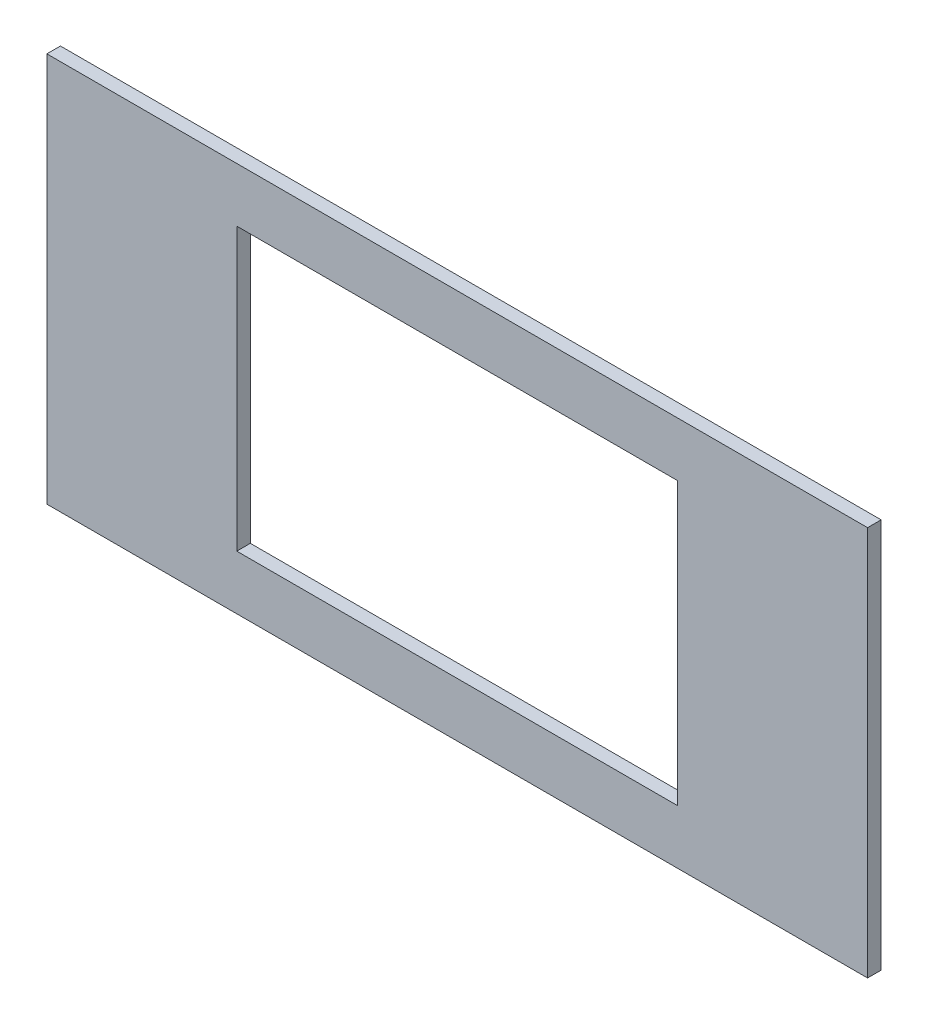
ISO-10303-21;
HEADER;
FILE_DESCRIPTION(('STEP AP214'),'2;1');
FILE_NAME('part.step','',(''),(''),'','','');
FILE_SCHEMA(('AUTOMOTIVE_DESIGN { 1 0 10303 214 1 1 1 1 }'));
ENDSEC;
DATA;
#1=APPLICATION_CONTEXT('core data for automotive mechanical design processes');
#2=APPLICATION_PROTOCOL_DEFINITION('international standard','automotive_design',2000,#1);
#3=PRODUCT_CONTEXT('',#1,'mechanical');
#4=PRODUCT('Part','Part','',(#3));
#5=PRODUCT_RELATED_PRODUCT_CATEGORY('part','',(#4));
#6=PRODUCT_DEFINITION_FORMATION('','',#4);
#7=PRODUCT_DEFINITION_CONTEXT('part definition',#1,'design');
#8=PRODUCT_DEFINITION('design','',#6,#7);
#9=PRODUCT_DEFINITION_SHAPE('','',#8);
#10=(LENGTH_UNIT() NAMED_UNIT(*) SI_UNIT(.MILLI.,.METRE.));
#11=(NAMED_UNIT(*) PLANE_ANGLE_UNIT() SI_UNIT($,.RADIAN.));
#12=(NAMED_UNIT(*) SI_UNIT($,.STERADIAN.) SOLID_ANGLE_UNIT());
#13=UNCERTAINTY_MEASURE_WITH_UNIT(LENGTH_MEASURE(1.E-05),#10,'distance_accuracy_value','');
#14=(GEOMETRIC_REPRESENTATION_CONTEXT(3) GLOBAL_UNCERTAINTY_ASSIGNED_CONTEXT((#13)) GLOBAL_UNIT_ASSIGNED_CONTEXT((#10,
#11,#12)) REPRESENTATION_CONTEXT('',''));
#15=CARTESIAN_POINT('',(0.,0.,0.));
#16=DIRECTION('',(0.,0.,1.));
#17=DIRECTION('',(1.,0.,0.));
#18=AXIS2_PLACEMENT_3D('',#15,#16,#17);
#19=CARTESIAN_POINT('',(0.,0.,4.));
#20=DIRECTION('',(0.,0.,1.));
#21=DIRECTION('',(1.,0.,0.));
#22=AXIS2_PLACEMENT_3D('',#19,#20,#21);
#23=PLANE('',#22);
#24=DIRECTION('',(0.,-1.,0.));
#25=VECTOR('',#24,1.);
#26=CARTESIAN_POINT('',(-99.0399274047187,66.2096188747731,4.));
#27=LINE('',#26,#25);
#28=CARTESIAN_POINT('',(-99.0399274047187,66.2096188747731,4.));
#29=VERTEX_POINT('',#28);
#30=CARTESIAN_POINT('',(-99.0399274047187,-48.7903811252269,4.));
#31=VERTEX_POINT('',#30);
#32=EDGE_CURVE('E157',#29,#31,#27,.T.);
#33=ORIENTED_EDGE('',*,*,#32,.T.);
#34=DIRECTION('',(1.,0.,0.));
#35=VECTOR('',#34,1.);
#36=CARTESIAN_POINT('',(-99.0399274047187,-48.7903811252269,4.));
#37=LINE('',#36,#35);
#38=CARTESIAN_POINT('',(142.960072595281,-48.7903811252269,4.));
#39=VERTEX_POINT('',#38);
#40=EDGE_CURVE('E161',#31,#39,#37,.T.);
#41=ORIENTED_EDGE('',*,*,#40,.T.);
#42=DIRECTION('',(0.,1.,0.));
#43=VECTOR('',#42,1.);
#44=CARTESIAN_POINT('',(142.960072595281,66.2096188747731,4.));
#45=LINE('',#44,#43);
#46=CARTESIAN_POINT('',(142.960072595281,66.2096188747731,4.));
#47=VERTEX_POINT('',#46);
#48=EDGE_CURVE('E165',#39,#47,#45,.T.);
#49=ORIENTED_EDGE('',*,*,#48,.T.);
#50=DIRECTION('',(-1.,0.,0.));
#51=VECTOR('',#50,1.);
#52=CARTESIAN_POINT('',(-99.0399274047187,66.2096188747731,4.));
#53=LINE('',#52,#51);
#54=EDGE_CURVE('E168',#47,#29,#53,.T.);
#55=ORIENTED_EDGE('',*,*,#54,.T.);
#56=EDGE_LOOP('',(#33,#41,#49,#55));
#57=FACE_BOUND('',#56,.T.);
#58=DIRECTION('',(1.,0.,0.));
#59=VECTOR('',#58,1.);
#60=CARTESIAN_POINT('',(-43.0399274047187,-32.7903811252269,4.));
#61=LINE('',#60,#59);
#62=CARTESIAN_POINT('',(-43.0399274047187,-32.7903811252269,4.));
#63=VERTEX_POINT('',#62);
#64=CARTESIAN_POINT('',(86.9600725952813,-32.7903811252269,4.));
#65=VERTEX_POINT('',#64);
#66=EDGE_CURVE('E118',#63,#65,#61,.T.);
#67=ORIENTED_EDGE('',*,*,#66,.F.);
#68=DIRECTION('',(0.,-1.,0.));
#69=VECTOR('',#68,1.);
#70=CARTESIAN_POINT('',(-43.0399274047187,50.2096188747731,4.));
#71=LINE('',#70,#69);
#72=CARTESIAN_POINT('',(-43.0399274047187,50.2096188747731,4.));
#73=VERTEX_POINT('',#72);
#74=EDGE_CURVE('E109',#73,#63,#71,.T.);
#75=ORIENTED_EDGE('',*,*,#74,.F.);
#76=DIRECTION('',(-1.,0.,0.));
#77=VECTOR('',#76,1.);
#78=CARTESIAN_POINT('',(-43.0399274047187,50.2096188747731,4.));
#79=LINE('',#78,#77);
#80=CARTESIAN_POINT('',(86.9600725952813,50.2096188747731,4.));
#81=VERTEX_POINT('',#80);
#82=EDGE_CURVE('E135',#81,#73,#79,.T.);
#83=ORIENTED_EDGE('',*,*,#82,.F.);
#84=DIRECTION('',(0.,1.,0.));
#85=VECTOR('',#84,1.);
#86=CARTESIAN_POINT('',(86.9600725952813,50.2096188747731,4.));
#87=LINE('',#86,#85);
#88=EDGE_CURVE('E131',#65,#81,#87,.T.);
#89=ORIENTED_EDGE('',*,*,#88,.F.);
#90=EDGE_LOOP('',(#67,#75,#83,#89));
#91=FACE_BOUND('',#90,.T.);
#92=ADVANCED_FACE('F43',(#57,#91),#23,.T.);
#93=CARTESIAN_POINT('',(0.,0.,0.));
#94=DIRECTION('',(0.,0.,1.));
#95=DIRECTION('',(1.,0.,0.));
#96=AXIS2_PLACEMENT_3D('',#93,#94,#95);
#97=PLANE('',#96);
#98=DIRECTION('',(0.,-1.,0.));
#99=VECTOR('',#98,1.);
#100=CARTESIAN_POINT('',(-99.0399274047187,66.2096188747731,0.));
#101=LINE('',#100,#99);
#102=CARTESIAN_POINT('',(-99.0399274047187,66.2096188747731,0.));
#103=VERTEX_POINT('',#102);
#104=CARTESIAN_POINT('',(-99.0399274047187,-48.7903811252269,0.));
#105=VERTEX_POINT('',#104);
#106=EDGE_CURVE('E127',#103,#105,#101,.T.);
#107=ORIENTED_EDGE('',*,*,#106,.F.);
#108=DIRECTION('',(-1.,0.,0.));
#109=VECTOR('',#108,1.);
#110=CARTESIAN_POINT('',(-99.0399274047187,66.2096188747731,0.));
#111=LINE('',#110,#109);
#112=CARTESIAN_POINT('',(142.960072595281,66.2096188747731,0.));
#113=VERTEX_POINT('',#112);
#114=EDGE_CURVE('E162',#113,#103,#111,.T.);
#115=ORIENTED_EDGE('',*,*,#114,.F.);
#116=DIRECTION('',(0.,1.,0.));
#117=VECTOR('',#116,1.);
#118=CARTESIAN_POINT('',(142.960072595281,66.2096188747731,0.));
#119=LINE('',#118,#117);
#120=CARTESIAN_POINT('',(142.960072595281,-48.7903811252269,0.));
#121=VERTEX_POINT('',#120);
#122=EDGE_CURVE('E178',#121,#113,#119,.T.);
#123=ORIENTED_EDGE('',*,*,#122,.F.);
#124=DIRECTION('',(1.,0.,0.));
#125=VECTOR('',#124,1.);
#126=CARTESIAN_POINT('',(-99.0399274047187,-48.7903811252269,0.));
#127=LINE('',#126,#125);
#128=EDGE_CURVE('E175',#105,#121,#127,.T.);
#129=ORIENTED_EDGE('',*,*,#128,.F.);
#130=EDGE_LOOP('',(#107,#115,#123,#129));
#131=FACE_BOUND('',#130,.T.);
#132=DIRECTION('',(0.,-1.,0.));
#133=VECTOR('',#132,1.);
#134=CARTESIAN_POINT('',(-43.0399274047187,50.2096188747731,0.));
#135=LINE('',#134,#133);
#136=CARTESIAN_POINT('',(-43.0399274047187,50.2096188747731,0.));
#137=VERTEX_POINT('',#136);
#138=CARTESIAN_POINT('',(-43.0399274047187,-32.7903811252269,0.));
#139=VERTEX_POINT('',#138);
#140=EDGE_CURVE('E67',#137,#139,#135,.T.);
#141=ORIENTED_EDGE('',*,*,#140,.T.);
#142=DIRECTION('',(1.,0.,0.));
#143=VECTOR('',#142,1.);
#144=CARTESIAN_POINT('',(-43.0399274047187,-32.7903811252269,0.));
#145=LINE('',#144,#143);
#146=CARTESIAN_POINT('',(86.9600725952813,-32.7903811252269,0.));
#147=VERTEX_POINT('',#146);
#148=EDGE_CURVE('E125',#139,#147,#145,.T.);
#149=ORIENTED_EDGE('',*,*,#148,.T.);
#150=DIRECTION('',(0.,1.,0.));
#151=VECTOR('',#150,1.);
#152=CARTESIAN_POINT('',(86.9600725952813,50.2096188747731,0.));
#153=LINE('',#152,#151);
#154=CARTESIAN_POINT('',(86.9600725952813,50.2096188747731,0.));
#155=VERTEX_POINT('',#154);
#156=EDGE_CURVE('E144',#147,#155,#153,.T.);
#157=ORIENTED_EDGE('',*,*,#156,.T.);
#158=DIRECTION('',(-1.,0.,0.));
#159=VECTOR('',#158,1.);
#160=CARTESIAN_POINT('',(-43.0399274047187,50.2096188747731,0.));
#161=LINE('',#160,#159);
#162=EDGE_CURVE('E119',#155,#137,#161,.T.);
#163=ORIENTED_EDGE('',*,*,#162,.T.);
#164=EDGE_LOOP('',(#141,#149,#157,#163));
#165=FACE_BOUND('',#164,.T.);
#166=ADVANCED_FACE('F201',(#131,#165),#97,.F.);
#167=CARTESIAN_POINT('',(-99.0399274047187,66.2096188747731,4.));
#168=DIRECTION('',(1.,0.,0.));
#169=DIRECTION('',(0.,1.,0.));
#170=AXIS2_PLACEMENT_3D('',#167,#168,#169);
#171=PLANE('',#170);
#172=ORIENTED_EDGE('',*,*,#106,.T.);
#173=DIRECTION('',(0.,0.,-1.));
#174=VECTOR('',#173,1.);
#175=CARTESIAN_POINT('',(-99.0399274047187,-48.7903811252269,4.));
#176=LINE('',#175,#174);
#177=EDGE_CURVE('E11',#31,#105,#176,.T.);
#178=ORIENTED_EDGE('',*,*,#177,.F.);
#179=ORIENTED_EDGE('',*,*,#32,.F.);
#180=DIRECTION('',(0.,0.,-1.));
#181=VECTOR('',#180,1.);
#182=CARTESIAN_POINT('',(-99.0399274047187,66.2096188747731,4.));
#183=LINE('',#182,#181);
#184=EDGE_CURVE('E171',#29,#103,#183,.T.);
#185=ORIENTED_EDGE('',*,*,#184,.T.);
#186=EDGE_LOOP('',(#172,#178,#179,#185));
#187=FACE_BOUND('',#186,.T.);
#188=ADVANCED_FACE('F45',(#187),#171,.F.);
#189=CARTESIAN_POINT('',(-99.0399274047187,-48.7903811252269,4.));
#190=DIRECTION('',(0.,1.,0.));
#191=DIRECTION('',(0.,0.,1.));
#192=AXIS2_PLACEMENT_3D('',#189,#190,#191);
#193=PLANE('',#192);
#194=ORIENTED_EDGE('',*,*,#128,.T.);
#195=DIRECTION('',(0.,0.,-1.));
#196=VECTOR('',#195,1.);
#197=CARTESIAN_POINT('',(142.960072595281,-48.7903811252269,4.));
#198=LINE('',#197,#196);
#199=EDGE_CURVE('E52',#39,#121,#198,.T.);
#200=ORIENTED_EDGE('',*,*,#199,.F.);
#201=ORIENTED_EDGE('',*,*,#40,.F.);
#202=ORIENTED_EDGE('',*,*,#177,.T.);
#203=EDGE_LOOP('',(#194,#200,#201,#202));
#204=FACE_BOUND('',#203,.T.);
#205=ADVANCED_FACE('F211',(#204),#193,.F.);
#206=CARTESIAN_POINT('',(142.960072595281,66.2096188747731,4.));
#207=DIRECTION('',(-1.,0.,0.));
#208=DIRECTION('',(0.,-1.,0.));
#209=AXIS2_PLACEMENT_3D('',#206,#207,#208);
#210=PLANE('',#209);
#211=ORIENTED_EDGE('',*,*,#122,.T.);
#212=DIRECTION('',(0.,0.,-1.));
#213=VECTOR('',#212,1.);
#214=CARTESIAN_POINT('',(142.960072595281,66.2096188747731,4.));
#215=LINE('',#214,#213);
#216=EDGE_CURVE('E186',#47,#113,#215,.T.);
#217=ORIENTED_EDGE('',*,*,#216,.F.);
#218=ORIENTED_EDGE('',*,*,#48,.F.);
#219=ORIENTED_EDGE('',*,*,#199,.T.);
#220=EDGE_LOOP('',(#211,#217,#218,#219));
#221=FACE_BOUND('',#220,.T.);
#222=ADVANCED_FACE('F195',(#221),#210,.F.);
#223=CARTESIAN_POINT('',(-99.0399274047187,66.2096188747731,4.));
#224=DIRECTION('',(0.,-1.,0.));
#225=DIRECTION('',(0.,0.,-1.));
#226=AXIS2_PLACEMENT_3D('',#223,#224,#225);
#227=PLANE('',#226);
#228=ORIENTED_EDGE('',*,*,#114,.T.);
#229=ORIENTED_EDGE('',*,*,#184,.F.);
#230=ORIENTED_EDGE('',*,*,#54,.F.);
#231=ORIENTED_EDGE('',*,*,#216,.T.);
#232=EDGE_LOOP('',(#228,#229,#230,#231));
#233=FACE_BOUND('',#232,.T.);
#234=ADVANCED_FACE('F205',(#233),#227,.F.);
#235=CARTESIAN_POINT('',(-43.0399274047187,50.2096188747731,4.));
#236=DIRECTION('',(1.,0.,0.));
#237=DIRECTION('',(0.,1.,0.));
#238=AXIS2_PLACEMENT_3D('',#235,#236,#237);
#239=PLANE('',#238);
#240=ORIENTED_EDGE('',*,*,#140,.F.);
#241=DIRECTION('',(0.,0.,-1.));
#242=VECTOR('',#241,1.);
#243=CARTESIAN_POINT('',(-43.0399274047187,50.2096188747731,4.));
#244=LINE('',#243,#242);
#245=EDGE_CURVE('E113',#73,#137,#244,.T.);
#246=ORIENTED_EDGE('',*,*,#245,.F.);
#247=ORIENTED_EDGE('',*,*,#74,.T.);
#248=DIRECTION('',(0.,0.,-1.));
#249=VECTOR('',#248,1.);
#250=CARTESIAN_POINT('',(-43.0399274047187,-32.7903811252269,4.));
#251=LINE('',#250,#249);
#252=EDGE_CURVE('E112',#63,#139,#251,.T.);
#253=ORIENTED_EDGE('',*,*,#252,.T.);
#254=EDGE_LOOP('',(#240,#246,#247,#253));
#255=FACE_BOUND('',#254,.T.);
#256=ADVANCED_FACE('F111',(#255),#239,.T.);
#257=CARTESIAN_POINT('',(-43.0399274047187,-32.7903811252269,4.));
#258=DIRECTION('',(0.,1.,0.));
#259=DIRECTION('',(0.,0.,1.));
#260=AXIS2_PLACEMENT_3D('',#257,#258,#259);
#261=PLANE('',#260);
#262=ORIENTED_EDGE('',*,*,#148,.F.);
#263=ORIENTED_EDGE('',*,*,#252,.F.);
#264=ORIENTED_EDGE('',*,*,#66,.T.);
#265=DIRECTION('',(0.,0.,-1.));
#266=VECTOR('',#265,1.);
#267=CARTESIAN_POINT('',(86.9600725952813,-32.7903811252269,4.));
#268=LINE('',#267,#266);
#269=EDGE_CURVE('E128',#65,#147,#268,.T.);
#270=ORIENTED_EDGE('',*,*,#269,.T.);
#271=EDGE_LOOP('',(#262,#263,#264,#270));
#272=FACE_BOUND('',#271,.T.);
#273=ADVANCED_FACE('F122',(#272),#261,.T.);
#274=CARTESIAN_POINT('',(86.9600725952813,50.2096188747731,4.));
#275=DIRECTION('',(-1.,0.,0.));
#276=DIRECTION('',(0.,0.,1.));
#277=AXIS2_PLACEMENT_3D('',#274,#275,#276);
#278=PLANE('',#277);
#279=ORIENTED_EDGE('',*,*,#156,.F.);
#280=ORIENTED_EDGE('',*,*,#269,.F.);
#281=ORIENTED_EDGE('',*,*,#88,.T.);
#282=DIRECTION('',(0.,0.,-1.));
#283=VECTOR('',#282,1.);
#284=CARTESIAN_POINT('',(86.9600725952813,50.2096188747731,4.));
#285=LINE('',#284,#283);
#286=EDGE_CURVE('E59',#81,#155,#285,.T.);
#287=ORIENTED_EDGE('',*,*,#286,.T.);
#288=EDGE_LOOP('',(#279,#280,#281,#287));
#289=FACE_BOUND('',#288,.T.);
#290=ADVANCED_FACE('F234',(#289),#278,.T.);
#291=CARTESIAN_POINT('',(-43.0399274047187,50.2096188747731,4.));
#292=DIRECTION('',(0.,-1.,0.));
#293=DIRECTION('',(0.,0.,-1.));
#294=AXIS2_PLACEMENT_3D('',#291,#292,#293);
#295=PLANE('',#294);
#296=ORIENTED_EDGE('',*,*,#162,.F.);
#297=ORIENTED_EDGE('',*,*,#286,.F.);
#298=ORIENTED_EDGE('',*,*,#82,.T.);
#299=ORIENTED_EDGE('',*,*,#245,.T.);
#300=EDGE_LOOP('',(#296,#297,#298,#299));
#301=FACE_BOUND('',#300,.T.);
#302=ADVANCED_FACE('F238',(#301),#295,.T.);
#303=CLOSED_SHELL('',(#92,#166,#188,#205,#222,#234,#256,#273,#290,#302));
#304=MANIFOLD_SOLID_BREP('B2',#303);
#305=ADVANCED_BREP_SHAPE_REPRESENTATION('',(#18,#304),#14);
#306=SHAPE_DEFINITION_REPRESENTATION(#9,#305);
ENDSEC;
END-ISO-10303-21;
